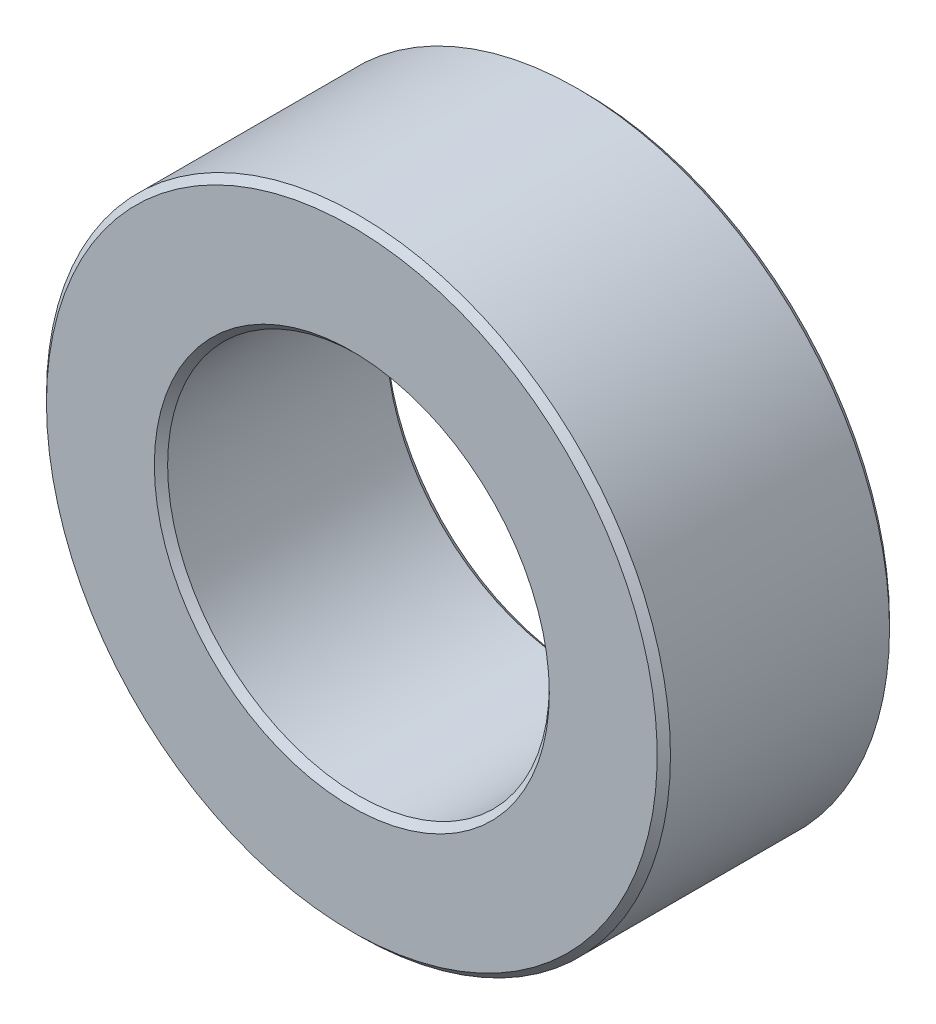
ISO-10303-21;
HEADER;
FILE_DESCRIPTION(('STEP AP214'),'2;1');
FILE_NAME('part.step','',(''),(''),'','','');
FILE_SCHEMA(('AUTOMOTIVE_DESIGN { 1 0 10303 214 1 1 1 1 }'));
ENDSEC;
DATA;
#1=APPLICATION_CONTEXT('core data for automotive mechanical design processes');
#2=APPLICATION_PROTOCOL_DEFINITION('international standard','automotive_design',2000,#1);
#3=PRODUCT_CONTEXT('',#1,'mechanical');
#4=PRODUCT('Part','Part','',(#3));
#5=PRODUCT_RELATED_PRODUCT_CATEGORY('part','',(#4));
#6=PRODUCT_DEFINITION_FORMATION('','',#4);
#7=PRODUCT_DEFINITION_CONTEXT('part definition',#1,'design');
#8=PRODUCT_DEFINITION('design','',#6,#7);
#9=PRODUCT_DEFINITION_SHAPE('','',#8);
#10=(LENGTH_UNIT() NAMED_UNIT(*) SI_UNIT(.MILLI.,.METRE.));
#11=(NAMED_UNIT(*) PLANE_ANGLE_UNIT() SI_UNIT($,.RADIAN.));
#12=(NAMED_UNIT(*) SI_UNIT($,.STERADIAN.) SOLID_ANGLE_UNIT());
#13=UNCERTAINTY_MEASURE_WITH_UNIT(LENGTH_MEASURE(1.E-05),#10,'distance_accuracy_value','');
#14=(GEOMETRIC_REPRESENTATION_CONTEXT(3) GLOBAL_UNCERTAINTY_ASSIGNED_CONTEXT((#13)) GLOBAL_UNIT_ASSIGNED_CONTEXT((#10,
#11,#12)) REPRESENTATION_CONTEXT('',''));
#15=CARTESIAN_POINT('',(0.,0.,0.));
#16=DIRECTION('',(0.,0.,1.));
#17=DIRECTION('',(1.,0.,0.));
#18=AXIS2_PLACEMENT_3D('',#15,#16,#17);
#19=CARTESIAN_POINT('',(0.,0.,-19.5));
#20=DIRECTION('',(0.,0.,-1.));
#21=DIRECTION('',(-1.,0.,0.));
#22=AXIS2_PLACEMENT_3D('',#19,#20,#21);
#23=CYLINDRICAL_SURFACE('',#22,5.75);
#24=CARTESIAN_POINT('',(0.,0.,-16.1999999999694));
#25=DIRECTION('',(0.,0.,1.));
#26=DIRECTION('',(0.,1.,0.));
#27=AXIS2_PLACEMENT_3D('',#24,#25,#26);
#28=CIRCLE('',#27,5.74999999997772);
#29=CARTESIAN_POINT('',(0.,5.74999999997772,-16.1999999999694));
#30=VERTEX_POINT('',#29);
#31=EDGE_CURVE('E32',#30,#30,#28,.T.);
#32=ORIENTED_EDGE('',*,*,#31,.T.);
#33=EDGE_LOOP('',(#32));
#34=FACE_BOUND('',#33,.T.);
#35=CARTESIAN_POINT('',(0.,0.,-22.7999999999611));
#36=DIRECTION('',(0.,0.,-1.));
#37=DIRECTION('',(0.,1.,0.));
#38=AXIS2_PLACEMENT_3D('',#35,#36,#37);
#39=CIRCLE('',#38,5.74999999992087);
#40=CARTESIAN_POINT('',(0.,5.74999999992087,-22.7999999999611));
#41=VERTEX_POINT('',#40);
#42=EDGE_CURVE('E29',#41,#41,#39,.T.);
#43=ORIENTED_EDGE('',*,*,#42,.T.);
#44=EDGE_LOOP('',(#43));
#45=FACE_BOUND('',#44,.T.);
#46=ADVANCED_FACE('F14',(#34,#45),#23,.F.);
#47=CARTESIAN_POINT('',(0.,8.18333333,-21.5));
#48=DIRECTION('',(0.,0.,-1.));
#49=DIRECTION('',(-1.,0.,0.));
#50=AXIS2_PLACEMENT_3D('',#47,#48,#49);
#51=PLANE('',#50);
#52=CARTESIAN_POINT('',(0.,8.18333333,-21.5));
#53=DIRECTION('',(0.,0.,1.));
#54=DIRECTION('',(1.,0.,0.));
#55=AXIS2_PLACEMENT_3D('',#52,#53,#54);
#56=CIRCLE('',#55,0.608333335290558);
#57=CARTESIAN_POINT('',(0.608333335290558,8.18333333,-21.5));
#58=VERTEX_POINT('',#57);
#59=EDGE_CURVE('E17',#58,#58,#56,.F.);
#60=ORIENTED_EDGE('',*,*,#59,.T.);
#61=EDGE_LOOP('',(#60));
#62=FACE_BOUND('',#61,.T.);
#63=ADVANCED_FACE('F70',(#62),#51,.T.);
#64=CARTESIAN_POINT('',(8.18333333,0.,-21.5));
#65=DIRECTION('',(0.,0.,1.));
#66=DIRECTION('',(1.,0.,0.));
#67=AXIS2_PLACEMENT_3D('',#64,#65,#66);
#68=PLANE('',#67);
#69=CARTESIAN_POINT('',(8.18333333,0.,-21.5));
#70=DIRECTION('',(0.,0.,1.));
#71=DIRECTION('',(1.,0.,0.));
#72=AXIS2_PLACEMENT_3D('',#69,#70,#71);
#73=CIRCLE('',#72,0.608333332366842);
#74=CARTESIAN_POINT('',(8.79166666236684,0.,-21.5));
#75=VERTEX_POINT('',#74);
#76=EDGE_CURVE('E63',#75,#75,#73,.F.);
#77=ORIENTED_EDGE('',*,*,#76,.T.);
#78=EDGE_LOOP('',(#77));
#79=FACE_BOUND('',#78,.T.);
#80=ADVANCED_FACE('F131',(#79),#68,.F.);
#81=CARTESIAN_POINT('',(0.,-8.18333333,-21.5));
#82=DIRECTION('',(0.,0.,1.));
#83=DIRECTION('',(1.,0.,0.));
#84=AXIS2_PLACEMENT_3D('',#81,#82,#83);
#85=PLANE('',#84);
#86=CARTESIAN_POINT('',(0.,-8.18333333,-21.5));
#87=DIRECTION('',(0.,0.,1.));
#88=DIRECTION('',(1.,0.,0.));
#89=AXIS2_PLACEMENT_3D('',#86,#87,#88);
#90=CIRCLE('',#89,0.608333332366842);
#91=CARTESIAN_POINT('',(0.608333332366842,-8.18333333,-21.5));
#92=VERTEX_POINT('',#91);
#93=EDGE_CURVE('E61',#92,#92,#90,.F.);
#94=ORIENTED_EDGE('',*,*,#93,.T.);
#95=EDGE_LOOP('',(#94));
#96=FACE_BOUND('',#95,.T.);
#97=ADVANCED_FACE('F128',(#96),#85,.F.);
#98=CARTESIAN_POINT('',(-8.18333333,0.,-21.5));
#99=DIRECTION('',(0.,0.,-1.));
#100=DIRECTION('',(-1.,0.,0.));
#101=AXIS2_PLACEMENT_3D('',#98,#99,#100);
#102=PLANE('',#101);
#103=CARTESIAN_POINT('',(-8.18333333,0.,-21.5));
#104=DIRECTION('',(0.,0.,1.));
#105=DIRECTION('',(1.,0.,0.));
#106=AXIS2_PLACEMENT_3D('',#103,#104,#105);
#107=CIRCLE('',#106,0.608333332366841);
#108=CARTESIAN_POINT('',(-7.57499999763316,0.,-21.5));
#109=VERTEX_POINT('',#108);
#110=EDGE_CURVE('E58',#109,#109,#107,.F.);
#111=ORIENTED_EDGE('',*,*,#110,.T.);
#112=EDGE_LOOP('',(#111));
#113=FACE_BOUND('',#112,.T.);
#114=ADVANCED_FACE('F130',(#113),#102,.T.);
#115=CARTESIAN_POINT('',(0.,0.,-16.0000000000196));
#116=DIRECTION('',(0.,0.,1.));
#117=DIRECTION('',(1.,0.,0.));
#118=AXIS2_PLACEMENT_3D('',#115,#116,#117);
#119=CONICAL_SURFACE('',#118,5.94999999992751,0.78539816325534);
#120=CARTESIAN_POINT('',(0.,0.,-15.9999999999627));
#121=DIRECTION('',(0.,0.,1.));
#122=DIRECTION('',(1.,0.,0.));
#123=AXIS2_PLACEMENT_3D('',#120,#121,#122);
#124=CIRCLE('',#123,5.94999999998436);
#125=CARTESIAN_POINT('',(5.94999999998436,0.,-15.9999999999627));
#126=VERTEX_POINT('',#125);
#127=EDGE_CURVE('E55',#126,#126,#124,.F.);
#128=ORIENTED_EDGE('',*,*,#127,.F.);
#129=EDGE_LOOP('',(#128));
#130=FACE_BOUND('',#129,.T.);
#131=ORIENTED_EDGE('',*,*,#31,.F.);
#132=EDGE_LOOP('',(#131));
#133=FACE_BOUND('',#132,.T.);
#134=ADVANCED_FACE('F87',(#130,#133),#119,.F.);
#135=CARTESIAN_POINT('',(0.,0.,-22.9999999999109));
#136=DIRECTION('',(0.,0.,-1.));
#137=DIRECTION('',(-1.,0.,0.));
#138=AXIS2_PLACEMENT_3D('',#135,#136,#137);
#139=CONICAL_SURFACE('',#138,5.94999999987067,0.785398163397448);
#140=ORIENTED_EDGE('',*,*,#42,.F.);
#141=EDGE_LOOP('',(#140));
#142=FACE_BOUND('',#141,.T.);
#143=CARTESIAN_POINT('',(0.,0.,-22.9999999999677));
#144=DIRECTION('',(0.,0.,-1.));
#145=DIRECTION('',(-1.,0.,0.));
#146=AXIS2_PLACEMENT_3D('',#143,#144,#145);
#147=CIRCLE('',#146,5.94999999992751);
#148=CARTESIAN_POINT('',(-5.94999999992751,0.,-22.9999999999677));
#149=VERTEX_POINT('',#148);
#150=EDGE_CURVE('E52',#149,#149,#147,.F.);
#151=ORIENTED_EDGE('',*,*,#150,.F.);
#152=EDGE_LOOP('',(#151));
#153=FACE_BOUND('',#152,.T.);
#154=ADVANCED_FACE('F75',(#142,#153),#139,.F.);
#155=CARTESIAN_POINT('',(0.,8.18333333,-23.));
#156=DIRECTION('',(0.,0.,1.));
#157=DIRECTION('',(1.,0.,0.));
#158=AXIS2_PLACEMENT_3D('',#155,#156,#157);
#159=CYLINDRICAL_SURFACE('',#158,0.608333335290558);
#160=CARTESIAN_POINT('',(0.,8.18333333,-23.));
#161=DIRECTION('',(0.,0.,1.));
#162=DIRECTION('',(1.,0.,0.));
#163=AXIS2_PLACEMENT_3D('',#160,#161,#162);
#164=CIRCLE('',#163,0.608333335290558);
#165=CARTESIAN_POINT('',(0.608333335290558,8.18333333,-23.));
#166=VERTEX_POINT('',#165);
#167=EDGE_CURVE('E49',#166,#166,#164,.T.);
#168=ORIENTED_EDGE('',*,*,#167,.F.);
#169=EDGE_LOOP('',(#168));
#170=FACE_BOUND('',#169,.T.);
#171=ORIENTED_EDGE('',*,*,#59,.F.);
#172=EDGE_LOOP('',(#171));
#173=FACE_BOUND('',#172,.T.);
#174=ADVANCED_FACE('F72',(#170,#173),#159,.F.);
#175=CARTESIAN_POINT('',(8.18333333,0.,-23.));
#176=DIRECTION('',(0.,0.,1.));
#177=DIRECTION('',(1.,0.,0.));
#178=AXIS2_PLACEMENT_3D('',#175,#176,#177);
#179=CYLINDRICAL_SURFACE('',#178,0.608333332366842);
#180=CARTESIAN_POINT('',(8.18333333,0.,-23.));
#181=DIRECTION('',(0.,0.,1.));
#182=DIRECTION('',(1.,0.,0.));
#183=AXIS2_PLACEMENT_3D('',#180,#181,#182);
#184=CIRCLE('',#183,0.608333332366842);
#185=CARTESIAN_POINT('',(8.79166666236684,0.,-23.));
#186=VERTEX_POINT('',#185);
#187=EDGE_CURVE('E46',#186,#186,#184,.T.);
#188=ORIENTED_EDGE('',*,*,#187,.F.);
#189=EDGE_LOOP('',(#188));
#190=FACE_BOUND('',#189,.T.);
#191=ORIENTED_EDGE('',*,*,#76,.F.);
#192=EDGE_LOOP('',(#191));
#193=FACE_BOUND('',#192,.T.);
#194=ADVANCED_FACE('F74',(#190,#193),#179,.F.);
#195=CARTESIAN_POINT('',(0.,-8.18333333,-23.));
#196=DIRECTION('',(0.,0.,1.));
#197=DIRECTION('',(1.,0.,0.));
#198=AXIS2_PLACEMENT_3D('',#195,#196,#197);
#199=CYLINDRICAL_SURFACE('',#198,0.608333332366842);
#200=CARTESIAN_POINT('',(0.,-8.18333333,-23.));
#201=DIRECTION('',(0.,0.,1.));
#202=DIRECTION('',(1.,0.,0.));
#203=AXIS2_PLACEMENT_3D('',#200,#201,#202);
#204=CIRCLE('',#203,0.608333332366842);
#205=CARTESIAN_POINT('',(0.608333332366842,-8.18333333,-23.));
#206=VERTEX_POINT('',#205);
#207=EDGE_CURVE('E43',#206,#206,#204,.T.);
#208=ORIENTED_EDGE('',*,*,#207,.F.);
#209=EDGE_LOOP('',(#208));
#210=FACE_BOUND('',#209,.T.);
#211=ORIENTED_EDGE('',*,*,#93,.F.);
#212=EDGE_LOOP('',(#211));
#213=FACE_BOUND('',#212,.T.);
#214=ADVANCED_FACE('F84',(#210,#213),#199,.F.);
#215=CARTESIAN_POINT('',(-8.18333333,0.,-23.));
#216=DIRECTION('',(0.,0.,1.));
#217=DIRECTION('',(1.,0.,0.));
#218=AXIS2_PLACEMENT_3D('',#215,#216,#217);
#219=CYLINDRICAL_SURFACE('',#218,0.608333332366841);
#220=CARTESIAN_POINT('',(-8.18333333,0.,-23.));
#221=DIRECTION('',(0.,0.,1.));
#222=DIRECTION('',(1.,0.,0.));
#223=AXIS2_PLACEMENT_3D('',#220,#221,#222);
#224=CIRCLE('',#223,0.608333332366841);
#225=CARTESIAN_POINT('',(-7.57499999763316,0.,-23.));
#226=VERTEX_POINT('',#225);
#227=EDGE_CURVE('E40',#226,#226,#224,.T.);
#228=ORIENTED_EDGE('',*,*,#227,.F.);
#229=EDGE_LOOP('',(#228));
#230=FACE_BOUND('',#229,.T.);
#231=ORIENTED_EDGE('',*,*,#110,.F.);
#232=EDGE_LOOP('',(#231));
#233=FACE_BOUND('',#232,.T.);
#234=ADVANCED_FACE('F114',(#230,#233),#219,.F.);
#235=CARTESIAN_POINT('',(0.,7.575,-16.));
#236=DIRECTION('',(0.,0.,1.));
#237=DIRECTION('',(1.,0.,0.));
#238=AXIS2_PLACEMENT_3D('',#235,#236,#237);
#239=PLANE('',#238);
#240=ORIENTED_EDGE('',*,*,#127,.T.);
#241=EDGE_LOOP('',(#240));
#242=FACE_BOUND('',#241,.T.);
#243=CARTESIAN_POINT('',(0.,0.,-16.));
#244=DIRECTION('',(0.,0.,-1.));
#245=DIRECTION('',(-1.,0.,0.));
#246=AXIS2_PLACEMENT_3D('',#243,#244,#245);
#247=CIRCLE('',#246,9.2);
#248=CARTESIAN_POINT('',(-9.2,0.,-16.));
#249=VERTEX_POINT('',#248);
#250=EDGE_CURVE('E37',#249,#249,#247,.T.);
#251=ORIENTED_EDGE('',*,*,#250,.F.);
#252=EDGE_LOOP('',(#251));
#253=FACE_BOUND('',#252,.T.);
#254=ADVANCED_FACE('F110',(#242,#253),#239,.T.);
#255=CARTESIAN_POINT('',(0.,7.575,-23.));
#256=DIRECTION('',(0.,0.,-1.));
#257=DIRECTION('',(-1.,0.,0.));
#258=AXIS2_PLACEMENT_3D('',#255,#256,#257);
#259=PLANE('',#258);
#260=ORIENTED_EDGE('',*,*,#227,.T.);
#261=EDGE_LOOP('',(#260));
#262=FACE_BOUND('',#261,.T.);
#263=ORIENTED_EDGE('',*,*,#207,.T.);
#264=EDGE_LOOP('',(#263));
#265=FACE_BOUND('',#264,.T.);
#266=ORIENTED_EDGE('',*,*,#187,.T.);
#267=EDGE_LOOP('',(#266));
#268=FACE_BOUND('',#267,.T.);
#269=ORIENTED_EDGE('',*,*,#167,.T.);
#270=EDGE_LOOP('',(#269));
#271=FACE_BOUND('',#270,.T.);
#272=ORIENTED_EDGE('',*,*,#150,.T.);
#273=EDGE_LOOP('',(#272));
#274=FACE_BOUND('',#273,.T.);
#275=CARTESIAN_POINT('',(0.,0.,-23.));
#276=DIRECTION('',(0.,0.,1.));
#277=DIRECTION('',(1.,0.,0.));
#278=AXIS2_PLACEMENT_3D('',#275,#276,#277);
#279=CIRCLE('',#278,9.2);
#280=CARTESIAN_POINT('',(9.2,0.,-23.));
#281=VERTEX_POINT('',#280);
#282=EDGE_CURVE('E26',#281,#281,#279,.T.);
#283=ORIENTED_EDGE('',*,*,#282,.F.);
#284=EDGE_LOOP('',(#283));
#285=FACE_BOUND('',#284,.T.);
#286=ADVANCED_FACE('F106',(#262,#265,#268,#271,#274,#285),#259,.T.);
#287=CARTESIAN_POINT('',(0.,0.,-16.2));
#288=DIRECTION('',(0.,0.,-1.));
#289=DIRECTION('',(-1.,0.,0.));
#290=AXIS2_PLACEMENT_3D('',#287,#288,#289);
#291=CONICAL_SURFACE('',#290,9.4,0.785398163397457);
#292=ORIENTED_EDGE('',*,*,#250,.T.);
#293=EDGE_LOOP('',(#292));
#294=FACE_BOUND('',#293,.T.);
#295=CARTESIAN_POINT('',(0.,0.,-16.2));
#296=DIRECTION('',(0.,0.,-1.));
#297=DIRECTION('',(-1.,0.,0.));
#298=AXIS2_PLACEMENT_3D('',#295,#296,#297);
#299=CIRCLE('',#298,9.4);
#300=CARTESIAN_POINT('',(-9.4,0.,-16.2));
#301=VERTEX_POINT('',#300);
#302=EDGE_CURVE('E21',#301,#301,#299,.T.);
#303=ORIENTED_EDGE('',*,*,#302,.F.);
#304=EDGE_LOOP('',(#303));
#305=FACE_BOUND('',#304,.T.);
#306=ADVANCED_FACE('F100',(#294,#305),#291,.T.);
#307=CARTESIAN_POINT('',(0.,0.,-22.8));
#308=DIRECTION('',(0.,0.,1.));
#309=DIRECTION('',(1.,0.,0.));
#310=AXIS2_PLACEMENT_3D('',#307,#308,#309);
#311=CONICAL_SURFACE('',#310,9.4,0.785398163397457);
#312=ORIENTED_EDGE('',*,*,#282,.T.);
#313=EDGE_LOOP('',(#312));
#314=FACE_BOUND('',#313,.T.);
#315=CARTESIAN_POINT('',(0.,0.,-22.8));
#316=DIRECTION('',(0.,0.,-1.));
#317=DIRECTION('',(-1.,0.,0.));
#318=AXIS2_PLACEMENT_3D('',#315,#316,#317);
#319=CIRCLE('',#318,9.4);
#320=CARTESIAN_POINT('',(-9.4,0.,-22.8));
#321=VERTEX_POINT('',#320);
#322=EDGE_CURVE('E10',#321,#321,#319,.F.);
#323=ORIENTED_EDGE('',*,*,#322,.F.);
#324=EDGE_LOOP('',(#323));
#325=FACE_BOUND('',#324,.T.);
#326=ADVANCED_FACE('F93',(#314,#325),#311,.T.);
#327=CARTESIAN_POINT('',(0.,0.,-19.5));
#328=DIRECTION('',(0.,0.,-1.));
#329=DIRECTION('',(-1.,0.,0.));
#330=AXIS2_PLACEMENT_3D('',#327,#328,#329);
#331=CYLINDRICAL_SURFACE('',#330,9.4);
#332=ORIENTED_EDGE('',*,*,#302,.T.);
#333=EDGE_LOOP('',(#332));
#334=FACE_BOUND('',#333,.T.);
#335=ORIENTED_EDGE('',*,*,#322,.T.);
#336=EDGE_LOOP('',(#335));
#337=FACE_BOUND('',#336,.T.);
#338=ADVANCED_FACE('F91',(#334,#337),#331,.T.);
#339=CLOSED_SHELL('',(#46,#63,#80,#97,#114,#134,#154,#174,#194,#214,#234,#254,#286,#306,#326,#338));
#340=MANIFOLD_SOLID_BREP('B1',#339);
#341=ADVANCED_BREP_SHAPE_REPRESENTATION('',(#18,#340),#14);
#342=SHAPE_DEFINITION_REPRESENTATION(#9,#341);
ENDSEC;
END-ISO-10303-21;
